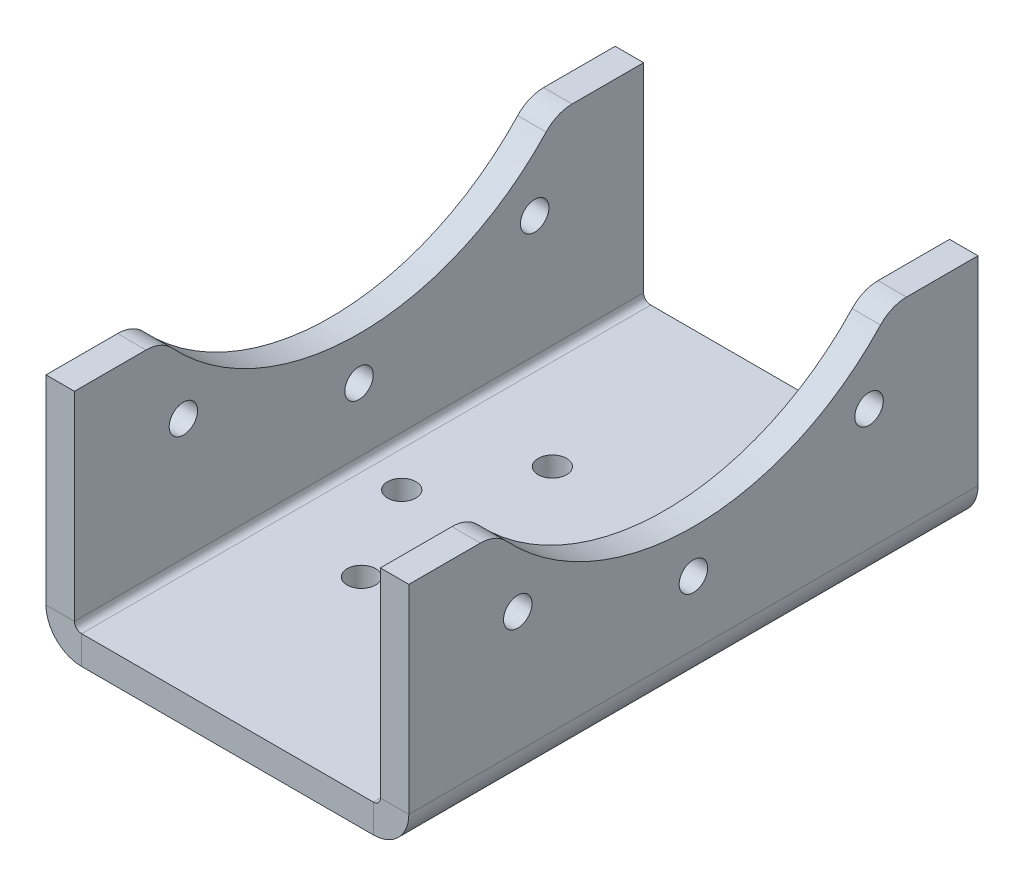
ISO-10303-21;
HEADER;
FILE_DESCRIPTION(('STEP AP214'),'2;1');
FILE_NAME('part.step','',(''),(''),'','','');
FILE_SCHEMA(('AUTOMOTIVE_DESIGN { 1 0 10303 214 1 1 1 1 }'));
ENDSEC;
DATA;
#1=APPLICATION_CONTEXT('core data for automotive mechanical design processes');
#2=APPLICATION_PROTOCOL_DEFINITION('international standard','automotive_design',2000,#1);
#3=PRODUCT_CONTEXT('',#1,'mechanical');
#4=PRODUCT('Part','Part','',(#3));
#5=PRODUCT_RELATED_PRODUCT_CATEGORY('part','',(#4));
#6=PRODUCT_DEFINITION_FORMATION('','',#4);
#7=PRODUCT_DEFINITION_CONTEXT('part definition',#1,'design');
#8=PRODUCT_DEFINITION('design','',#6,#7);
#9=PRODUCT_DEFINITION_SHAPE('','',#8);
#10=(LENGTH_UNIT() NAMED_UNIT(*) SI_UNIT(.MILLI.,.METRE.));
#11=(NAMED_UNIT(*) PLANE_ANGLE_UNIT() SI_UNIT($,.RADIAN.));
#12=(NAMED_UNIT(*) SI_UNIT($,.STERADIAN.) SOLID_ANGLE_UNIT());
#13=UNCERTAINTY_MEASURE_WITH_UNIT(LENGTH_MEASURE(1.E-05),#10,'distance_accuracy_value','');
#14=(GEOMETRIC_REPRESENTATION_CONTEXT(3) GLOBAL_UNCERTAINTY_ASSIGNED_CONTEXT((#13)) GLOBAL_UNIT_ASSIGNED_CONTEXT((#10,
#11,#12)) REPRESENTATION_CONTEXT('',''));
#15=CARTESIAN_POINT('',(0.,0.,0.));
#16=DIRECTION('',(0.,0.,1.));
#17=DIRECTION('',(1.,0.,0.));
#18=AXIS2_PLACEMENT_3D('',#15,#16,#17);
#19=CARTESIAN_POINT('',(-25.5,29.,80.));
#20=DIRECTION('',(0.,1.,0.));
#21=DIRECTION('',(0.,0.,1.));
#22=AXIS2_PLACEMENT_3D('',#19,#20,#21);
#23=PLANE('',#22);
#24=DIRECTION('',(0.,0.,-1.));
#25=VECTOR('',#24,1.);
#26=CARTESIAN_POINT('',(-25.5,29.,80.));
#27=LINE('',#26,#25);
#28=CARTESIAN_POINT('',(-25.5,29.,10.0500417362561));
#29=VERTEX_POINT('',#28);
#30=CARTESIAN_POINT('',(-25.5,29.,0.));
#31=VERTEX_POINT('',#30);
#32=EDGE_CURVE('E341',#29,#31,#27,.T.);
#33=ORIENTED_EDGE('',*,*,#32,.F.);
#34=DIRECTION('',(1.,0.,0.));
#35=VECTOR('',#34,1.);
#36=CARTESIAN_POINT('',(-21.5,29.,10.0500417362561));
#37=LINE('',#36,#35);
#38=CARTESIAN_POINT('',(-21.5,29.,10.0500417362561));
#39=VERTEX_POINT('',#38);
#40=EDGE_CURVE('E407',#29,#39,#37,.T.);
#41=ORIENTED_EDGE('',*,*,#40,.T.);
#42=DIRECTION('',(0.,0.,-1.));
#43=VECTOR('',#42,1.);
#44=CARTESIAN_POINT('',(-21.5,29.,80.));
#45=LINE('',#44,#43);
#46=CARTESIAN_POINT('',(-21.5,29.,0.));
#47=VERTEX_POINT('',#46);
#48=EDGE_CURVE('E206',#39,#47,#45,.T.);
#49=ORIENTED_EDGE('',*,*,#48,.T.);
#50=DIRECTION('',(1.,0.,0.));
#51=VECTOR('',#50,1.);
#52=CARTESIAN_POINT('',(-25.5,29.,0.));
#53=LINE('',#52,#51);
#54=EDGE_CURVE('E258',#31,#47,#53,.T.);
#55=ORIENTED_EDGE('',*,*,#54,.F.);
#56=EDGE_LOOP('',(#33,#41,#49,#55));
#57=FACE_BOUND('',#56,.T.);
#58=ADVANCED_FACE('F43',(#57),#23,.T.);
#59=CARTESIAN_POINT('',(21.5,29.,80.));
#60=DIRECTION('',(0.,1.,0.));
#61=DIRECTION('',(0.,0.,1.));
#62=AXIS2_PLACEMENT_3D('',#59,#60,#61);
#63=PLANE('',#62);
#64=DIRECTION('',(0.,0.,-1.));
#65=VECTOR('',#64,1.);
#66=CARTESIAN_POINT('',(21.5,29.,80.));
#67=LINE('',#66,#65);
#68=CARTESIAN_POINT('',(21.5,29.,10.0500417362561));
#69=VERTEX_POINT('',#68);
#70=CARTESIAN_POINT('',(21.5,29.,0.));
#71=VERTEX_POINT('',#70);
#72=EDGE_CURVE('E316',#69,#71,#67,.T.);
#73=ORIENTED_EDGE('',*,*,#72,.F.);
#74=DIRECTION('',(1.,0.,0.));
#75=VECTOR('',#74,1.);
#76=CARTESIAN_POINT('',(25.5,29.,10.0500417362561));
#77=LINE('',#76,#75);
#78=CARTESIAN_POINT('',(25.5,29.,10.0500417362561));
#79=VERTEX_POINT('',#78);
#80=EDGE_CURVE('E69',#69,#79,#77,.T.);
#81=ORIENTED_EDGE('',*,*,#80,.T.);
#82=DIRECTION('',(0.,0.,-1.));
#83=VECTOR('',#82,1.);
#84=CARTESIAN_POINT('',(25.5,29.,80.));
#85=LINE('',#84,#83);
#86=CARTESIAN_POINT('',(25.5,29.,0.));
#87=VERTEX_POINT('',#86);
#88=EDGE_CURVE('E321',#79,#87,#85,.T.);
#89=ORIENTED_EDGE('',*,*,#88,.T.);
#90=DIRECTION('',(1.,0.,0.));
#91=VECTOR('',#90,1.);
#92=CARTESIAN_POINT('',(21.5,29.,0.));
#93=LINE('',#92,#91);
#94=EDGE_CURVE('E283',#71,#87,#93,.T.);
#95=ORIENTED_EDGE('',*,*,#94,.F.);
#96=EDGE_LOOP('',(#73,#81,#89,#95));
#97=FACE_BOUND('',#96,.T.);
#98=ADVANCED_FACE('F511',(#97),#63,.T.);
#99=CARTESIAN_POINT('',(21.5,1.00000000000001,80.));
#100=DIRECTION('',(0.,0.,1.));
#101=DIRECTION('',(1.,0.,0.));
#102=AXIS2_PLACEMENT_3D('',#99,#100,#101);
#103=PLANE('',#102);
#104=DIRECTION('',(1.,0.,0.));
#105=VECTOR('',#104,1.);
#106=CARTESIAN_POINT('',(21.5,1.00000000000001,80.));
#107=LINE('',#106,#105);
#108=CARTESIAN_POINT('',(21.5,1.00000000000001,80.));
#109=VERTEX_POINT('',#108);
#110=CARTESIAN_POINT('',(25.5,1.,80.));
#111=VERTEX_POINT('',#110);
#112=EDGE_CURVE('E363',#109,#111,#107,.T.);
#113=ORIENTED_EDGE('',*,*,#112,.F.);
#114=CARTESIAN_POINT('',(20.5,1.00000000000001,80.));
#115=DIRECTION('',(0.,0.,1.));
#116=DIRECTION('',(1.,0.,0.));
#117=AXIS2_PLACEMENT_3D('',#114,#115,#116);
#118=CIRCLE('',#117,1.);
#119=CARTESIAN_POINT('',(20.5,0.,80.));
#120=VERTEX_POINT('',#119);
#121=EDGE_CURVE('E242',#109,#120,#118,.F.);
#122=ORIENTED_EDGE('',*,*,#121,.T.);
#123=DIRECTION('',(0.,1.,0.));
#124=VECTOR('',#123,1.);
#125=CARTESIAN_POINT('',(20.5,-3.99999999999999,80.));
#126=LINE('',#125,#124);
#127=CARTESIAN_POINT('',(20.5,-3.99999999999999,80.));
#128=VERTEX_POINT('',#127);
#129=EDGE_CURVE('E360',#128,#120,#126,.T.);
#130=ORIENTED_EDGE('',*,*,#129,.F.);
#131=CARTESIAN_POINT('',(20.5,1.00000000000001,80.));
#132=DIRECTION('',(0.,0.,1.));
#133=DIRECTION('',(1.,0.,0.));
#134=AXIS2_PLACEMENT_3D('',#131,#132,#133);
#135=CIRCLE('',#134,5.);
#136=EDGE_CURVE('E226',#111,#128,#135,.F.);
#137=ORIENTED_EDGE('',*,*,#136,.F.);
#138=EDGE_LOOP('',(#113,#122,#130,#137));
#139=FACE_BOUND('',#138,.T.);
#140=ADVANCED_FACE('F517',(#139),#103,.T.);
#141=CARTESIAN_POINT('',(20.5,-3.99999999999999,80.));
#142=DIRECTION('',(0.,0.,1.));
#143=DIRECTION('',(1.,0.,0.));
#144=AXIS2_PLACEMENT_3D('',#141,#142,#143);
#145=PLANE('',#144);
#146=DIRECTION('',(0.,-1.,0.));
#147=VECTOR('',#146,1.);
#148=CARTESIAN_POINT('',(21.5,0.,80.));
#149=LINE('',#148,#147);
#150=CARTESIAN_POINT('',(21.5,29.,80.));
#151=VERTEX_POINT('',#150);
#152=EDGE_CURVE('E238',#151,#109,#149,.T.);
#153=ORIENTED_EDGE('',*,*,#152,.T.);
#154=ORIENTED_EDGE('',*,*,#112,.T.);
#155=DIRECTION('',(0.,1.,0.));
#156=VECTOR('',#155,1.);
#157=CARTESIAN_POINT('',(25.5,0.,80.));
#158=LINE('',#157,#156);
#159=CARTESIAN_POINT('',(25.5,29.,80.));
#160=VERTEX_POINT('',#159);
#161=EDGE_CURVE('E230',#160,#111,#158,.F.);
#162=ORIENTED_EDGE('',*,*,#161,.F.);
#163=DIRECTION('',(1.,0.,0.));
#164=VECTOR('',#163,1.);
#165=CARTESIAN_POINT('',(21.5,29.,80.));
#166=LINE('',#165,#164);
#167=EDGE_CURVE('E234',#151,#160,#166,.T.);
#168=ORIENTED_EDGE('',*,*,#167,.F.);
#169=EDGE_LOOP('',(#153,#154,#162,#168));
#170=FACE_BOUND('',#169,.T.);
#171=ADVANCED_FACE('F557',(#170),#145,.T.);
#172=CARTESIAN_POINT('',(20.5,0.,0.));
#173=DIRECTION('',(0.,0.,-1.));
#174=DIRECTION('',(-1.,0.,0.));
#175=AXIS2_PLACEMENT_3D('',#172,#173,#174);
#176=PLANE('',#175);
#177=DIRECTION('',(0.,-1.,0.));
#178=VECTOR('',#177,1.);
#179=CARTESIAN_POINT('',(20.5,0.,0.));
#180=LINE('',#179,#178);
#181=CARTESIAN_POINT('',(20.5,0.,0.));
#182=VERTEX_POINT('',#181);
#183=CARTESIAN_POINT('',(20.5,-3.99999999999999,0.));
#184=VERTEX_POINT('',#183);
#185=EDGE_CURVE('E357',#182,#184,#180,.T.);
#186=ORIENTED_EDGE('',*,*,#185,.F.);
#187=CARTESIAN_POINT('',(20.5,1.00000000000001,0.));
#188=DIRECTION('',(0.,0.,1.));
#189=DIRECTION('',(1.,0.,0.));
#190=AXIS2_PLACEMENT_3D('',#187,#188,#189);
#191=CIRCLE('',#190,1.);
#192=CARTESIAN_POINT('',(21.5,1.00000000000001,0.));
#193=VERTEX_POINT('',#192);
#194=EDGE_CURVE('E291',#193,#182,#191,.F.);
#195=ORIENTED_EDGE('',*,*,#194,.F.);
#196=DIRECTION('',(-1.,0.,0.));
#197=VECTOR('',#196,1.);
#198=CARTESIAN_POINT('',(25.5,1.,0.));
#199=LINE('',#198,#197);
#200=CARTESIAN_POINT('',(25.5,1.,0.));
#201=VERTEX_POINT('',#200);
#202=EDGE_CURVE('E354',#201,#193,#199,.T.);
#203=ORIENTED_EDGE('',*,*,#202,.F.);
#204=CARTESIAN_POINT('',(20.5,1.00000000000001,0.));
#205=DIRECTION('',(0.,0.,1.));
#206=DIRECTION('',(1.,0.,0.));
#207=AXIS2_PLACEMENT_3D('',#204,#205,#206);
#208=CIRCLE('',#207,5.);
#209=EDGE_CURVE('E275',#201,#184,#208,.F.);
#210=ORIENTED_EDGE('',*,*,#209,.T.);
#211=EDGE_LOOP('',(#186,#195,#203,#210));
#212=FACE_BOUND('',#211,.T.);
#213=ADVANCED_FACE('F553',(#212),#176,.T.);
#214=CARTESIAN_POINT('',(25.5,1.,0.));
#215=DIRECTION('',(0.,0.,-1.));
#216=DIRECTION('',(-1.,0.,0.));
#217=AXIS2_PLACEMENT_3D('',#214,#215,#216);
#218=PLANE('',#217);
#219=DIRECTION('',(-1.,0.,0.));
#220=VECTOR('',#219,1.);
#221=CARTESIAN_POINT('',(-21.5,0.,0.));
#222=LINE('',#221,#220);
#223=CARTESIAN_POINT('',(-20.5,0.,0.));
#224=VERTEX_POINT('',#223);
#225=EDGE_CURVE('E295',#182,#224,#222,.T.);
#226=ORIENTED_EDGE('',*,*,#225,.F.);
#227=ORIENTED_EDGE('',*,*,#185,.T.);
#228=DIRECTION('',(-1.,0.,0.));
#229=VECTOR('',#228,1.);
#230=CARTESIAN_POINT('',(-21.5,-4.,0.));
#231=LINE('',#230,#229);
#232=CARTESIAN_POINT('',(-20.5,-4.,0.));
#233=VERTEX_POINT('',#232);
#234=EDGE_CURVE('E271',#184,#233,#231,.T.);
#235=ORIENTED_EDGE('',*,*,#234,.T.);
#236=DIRECTION('',(0.,1.,0.));
#237=VECTOR('',#236,1.);
#238=CARTESIAN_POINT('',(-20.5,-4.,0.));
#239=LINE('',#238,#237);
#240=EDGE_CURVE('E205',#233,#224,#239,.T.);
#241=ORIENTED_EDGE('',*,*,#240,.T.);
#242=EDGE_LOOP('',(#226,#227,#235,#241));
#243=FACE_BOUND('',#242,.T.);
#244=ADVANCED_FACE('F549',(#243),#218,.T.);
#245=CARTESIAN_POINT('',(-20.5,0.,80.));
#246=DIRECTION('',(0.,0.,1.));
#247=DIRECTION('',(1.,0.,0.));
#248=AXIS2_PLACEMENT_3D('',#245,#246,#247);
#249=PLANE('',#248);
#250=DIRECTION('',(0.,-1.,0.));
#251=VECTOR('',#250,1.);
#252=CARTESIAN_POINT('',(-20.5,0.,80.));
#253=LINE('',#252,#251);
#254=CARTESIAN_POINT('',(-20.5,0.,80.));
#255=VERTEX_POINT('',#254);
#256=CARTESIAN_POINT('',(-20.5,-4.,80.));
#257=VERTEX_POINT('',#256);
#258=EDGE_CURVE('E351',#255,#257,#253,.T.);
#259=ORIENTED_EDGE('',*,*,#258,.F.);
#260=CARTESIAN_POINT('',(-20.5,1.,80.));
#261=DIRECTION('',(0.,0.,1.));
#262=DIRECTION('',(1.,0.,0.));
#263=AXIS2_PLACEMENT_3D('',#260,#261,#262);
#264=CIRCLE('',#263,1.);
#265=CARTESIAN_POINT('',(-21.5,0.999999999999999,80.));
#266=VERTEX_POINT('',#265);
#267=EDGE_CURVE('E250',#255,#266,#264,.F.);
#268=ORIENTED_EDGE('',*,*,#267,.T.);
#269=DIRECTION('',(1.,0.,0.));
#270=VECTOR('',#269,1.);
#271=CARTESIAN_POINT('',(-25.5,0.999999999999999,80.));
#272=LINE('',#271,#270);
#273=CARTESIAN_POINT('',(-25.5,0.999999999999999,80.));
#274=VERTEX_POINT('',#273);
#275=EDGE_CURVE('E190',#274,#266,#272,.T.);
#276=ORIENTED_EDGE('',*,*,#275,.F.);
#277=CARTESIAN_POINT('',(-20.5,1.,80.));
#278=DIRECTION('',(0.,0.,1.));
#279=DIRECTION('',(1.,0.,0.));
#280=AXIS2_PLACEMENT_3D('',#277,#278,#279);
#281=CIRCLE('',#280,5.);
#282=EDGE_CURVE('E215',#257,#274,#281,.F.);
#283=ORIENTED_EDGE('',*,*,#282,.F.);
#284=EDGE_LOOP('',(#259,#268,#276,#283));
#285=FACE_BOUND('',#284,.T.);
#286=ADVANCED_FACE('F545',(#285),#249,.T.);
#287=CARTESIAN_POINT('',(-25.5,0.999999999999999,80.));
#288=DIRECTION('',(0.,0.,1.));
#289=DIRECTION('',(1.,0.,0.));
#290=AXIS2_PLACEMENT_3D('',#287,#288,#289);
#291=PLANE('',#290);
#292=DIRECTION('',(-1.,0.,0.));
#293=VECTOR('',#292,1.);
#294=CARTESIAN_POINT('',(-21.5,0.,80.));
#295=LINE('',#294,#293);
#296=EDGE_CURVE('E246',#120,#255,#295,.T.);
#297=ORIENTED_EDGE('',*,*,#296,.T.);
#298=ORIENTED_EDGE('',*,*,#258,.T.);
#299=DIRECTION('',(-1.,0.,0.));
#300=VECTOR('',#299,1.);
#301=CARTESIAN_POINT('',(-21.5,-4.,80.));
#302=LINE('',#301,#300);
#303=EDGE_CURVE('E222',#128,#257,#302,.T.);
#304=ORIENTED_EDGE('',*,*,#303,.F.);
#305=ORIENTED_EDGE('',*,*,#129,.T.);
#306=EDGE_LOOP('',(#297,#298,#304,#305));
#307=FACE_BOUND('',#306,.T.);
#308=ADVANCED_FACE('F541',(#307),#291,.T.);
#309=CARTESIAN_POINT('',(-21.5,0.999999999999999,0.));
#310=DIRECTION('',(0.,0.,-1.));
#311=DIRECTION('',(-1.,0.,0.));
#312=AXIS2_PLACEMENT_3D('',#309,#310,#311);
#313=PLANE('',#312);
#314=DIRECTION('',(-1.,0.,0.));
#315=VECTOR('',#314,1.);
#316=CARTESIAN_POINT('',(-21.5,0.999999999999999,0.));
#317=LINE('',#316,#315);
#318=CARTESIAN_POINT('',(-21.5,0.999999999999999,0.));
#319=VERTEX_POINT('',#318);
#320=CARTESIAN_POINT('',(-25.5,0.999999999999999,0.));
#321=VERTEX_POINT('',#320);
#322=EDGE_CURVE('E346',#319,#321,#317,.T.);
#323=ORIENTED_EDGE('',*,*,#322,.F.);
#324=CARTESIAN_POINT('',(-20.5,1.,0.));
#325=DIRECTION('',(0.,0.,1.));
#326=DIRECTION('',(1.,0.,0.));
#327=AXIS2_PLACEMENT_3D('',#324,#325,#326);
#328=CIRCLE('',#327,1.);
#329=EDGE_CURVE('E195',#224,#319,#328,.F.);
#330=ORIENTED_EDGE('',*,*,#329,.F.);
#331=ORIENTED_EDGE('',*,*,#240,.F.);
#332=CARTESIAN_POINT('',(-20.5,1.,0.));
#333=DIRECTION('',(0.,0.,1.));
#334=DIRECTION('',(1.,0.,0.));
#335=AXIS2_PLACEMENT_3D('',#332,#333,#334);
#336=CIRCLE('',#335,5.);
#337=EDGE_CURVE('E267',#233,#321,#336,.F.);
#338=ORIENTED_EDGE('',*,*,#337,.T.);
#339=EDGE_LOOP('',(#323,#330,#331,#338));
#340=FACE_BOUND('',#339,.T.);
#341=ADVANCED_FACE('F535',(#340),#313,.T.);
#342=CARTESIAN_POINT('',(-20.5,-4.,0.));
#343=DIRECTION('',(0.,0.,-1.));
#344=DIRECTION('',(-1.,0.,0.));
#345=AXIS2_PLACEMENT_3D('',#342,#343,#344);
#346=PLANE('',#345);
#347=DIRECTION('',(0.,1.,0.));
#348=VECTOR('',#347,1.);
#349=CARTESIAN_POINT('',(-21.5,0.,0.));
#350=LINE('',#349,#348);
#351=EDGE_CURVE('E254',#319,#47,#350,.T.);
#352=ORIENTED_EDGE('',*,*,#351,.F.);
#353=ORIENTED_EDGE('',*,*,#322,.T.);
#354=DIRECTION('',(0.,1.,0.));
#355=VECTOR('',#354,1.);
#356=CARTESIAN_POINT('',(-25.5,0.,0.));
#357=LINE('',#356,#355);
#358=EDGE_CURVE('E263',#321,#31,#357,.T.);
#359=ORIENTED_EDGE('',*,*,#358,.T.);
#360=ORIENTED_EDGE('',*,*,#54,.T.);
#361=EDGE_LOOP('',(#352,#353,#359,#360));
#362=FACE_BOUND('',#361,.T.);
#363=ADVANCED_FACE('F531',(#362),#346,.T.);
#364=CARTESIAN_POINT('',(-21.5,0.,80.));
#365=DIRECTION('',(-1.,0.,0.));
#366=DIRECTION('',(0.,0.,1.));
#367=AXIS2_PLACEMENT_3D('',#364,#365,#366);
#368=PLANE('',#367);
#369=CARTESIAN_POINT('',(-21.5,18.0212862362522,64.6869805962839));
#370=DIRECTION('',(-1.,0.,0.));
#371=DIRECTION('',(0.,0.,1.));
#372=AXIS2_PLACEMENT_3D('',#369,#370,#371);
#373=CIRCLE('',#372,2.);
#374=CARTESIAN_POINT('',(-21.5,18.0212862362522,66.6869805962839));
#375=VERTEX_POINT('',#374);
#376=EDGE_CURVE('E259',#375,#375,#373,.T.);
#377=ORIENTED_EDGE('',*,*,#376,.T.);
#378=EDGE_LOOP('',(#377));
#379=FACE_BOUND('',#378,.T.);
#380=CARTESIAN_POINT('',(-21.5,18.0212862362522,15.3130194037161));
#381=DIRECTION('',(-1.,0.,0.));
#382=DIRECTION('',(0.,0.,1.));
#383=AXIS2_PLACEMENT_3D('',#380,#381,#382);
#384=CIRCLE('',#383,2.00000000000001);
#385=CARTESIAN_POINT('',(-21.5,18.0212862362522,17.3130194037161));
#386=VERTEX_POINT('',#385);
#387=EDGE_CURVE('E381',#386,#386,#384,.T.);
#388=ORIENTED_EDGE('',*,*,#387,.T.);
#389=EDGE_LOOP('',(#388));
#390=FACE_BOUND('',#389,.T.);
#391=CARTESIAN_POINT('',(-21.5,9.99999999999999,40.));
#392=DIRECTION('',(-1.,0.,0.));
#393=DIRECTION('',(0.,0.,1.));
#394=AXIS2_PLACEMENT_3D('',#391,#392,#393);
#395=CIRCLE('',#394,1.99999999999998);
#396=CARTESIAN_POINT('',(-21.5,9.99999999999999,42.));
#397=VERTEX_POINT('',#396);
#398=EDGE_CURVE('E375',#397,#397,#395,.T.);
#399=ORIENTED_EDGE('',*,*,#398,.T.);
#400=EDGE_LOOP('',(#399));
#401=FACE_BOUND('',#400,.T.);
#402=CARTESIAN_POINT('',(-21.5,52.,40.));
#403=DIRECTION('',(-1.,0.,0.));
#404=DIRECTION('',(0.,0.,1.));
#405=AXIS2_PLACEMENT_3D('',#402,#403,#404);
#406=CIRCLE('',#405,36.);
#407=CARTESIAN_POINT('',(-21.5,27.4146341463415,13.702475670859));
#408=VERTEX_POINT('',#407);
#409=CARTESIAN_POINT('',(-21.5,27.4146341463415,66.297524329141));
#410=VERTEX_POINT('',#409);
#411=EDGE_CURVE('E376',#408,#410,#406,.T.);
#412=ORIENTED_EDGE('',*,*,#411,.T.);
#413=CARTESIAN_POINT('',(-21.5,24.,69.9499582637439));
#414=DIRECTION('',(-1.,0.,0.));
#415=DIRECTION('',(0.,0.,1.));
#416=AXIS2_PLACEMENT_3D('',#413,#414,#415);
#417=CIRCLE('',#416,5.);
#418=CARTESIAN_POINT('',(-21.5,29.,69.9499582637439));
#419=VERTEX_POINT('',#418);
#420=EDGE_CURVE('E201',#410,#419,#417,.F.);
#421=ORIENTED_EDGE('',*,*,#420,.T.);
#422=CARTESIAN_POINT('',(-21.5,29.,80.));
#423=VERTEX_POINT('',#422);
#424=EDGE_CURVE('E198',#423,#419,#45,.T.);
#425=ORIENTED_EDGE('',*,*,#424,.F.);
#426=DIRECTION('',(0.,1.,0.));
#427=VECTOR('',#426,1.);
#428=CARTESIAN_POINT('',(-21.5,0.,80.));
#429=LINE('',#428,#427);
#430=EDGE_CURVE('E183',#266,#423,#429,.T.);
#431=ORIENTED_EDGE('',*,*,#430,.F.);
#432=DIRECTION('',(0.,0.,-1.));
#433=VECTOR('',#432,1.);
#434=CARTESIAN_POINT('',(-21.5,0.999999999999999,80.));
#435=LINE('',#434,#433);
#436=EDGE_CURVE('E253',#266,#319,#435,.T.);
#437=ORIENTED_EDGE('',*,*,#436,.T.);
#438=ORIENTED_EDGE('',*,*,#351,.T.);
#439=ORIENTED_EDGE('',*,*,#48,.F.);
#440=CARTESIAN_POINT('',(-21.5,24.,10.0500417362561));
#441=DIRECTION('',(-1.,0.,0.));
#442=DIRECTION('',(0.,0.,1.));
#443=AXIS2_PLACEMENT_3D('',#440,#441,#442);
#444=CIRCLE('',#443,5.);
#445=EDGE_CURVE('E393',#39,#408,#444,.F.);
#446=ORIENTED_EDGE('',*,*,#445,.T.);
#447=EDGE_LOOP('',(#412,#421,#425,#431,#437,#438,#439,#446));
#448=FACE_BOUND('',#447,.T.);
#449=ADVANCED_FACE('F200',(#379,#390,#401,#448),#368,.F.);
#450=ORIENTED_EDGE('',*,*,#424,.T.);
#451=DIRECTION('',(1.,0.,0.));
#452=VECTOR('',#451,1.);
#453=CARTESIAN_POINT('',(-25.5,29.,69.9499582637439));
#454=LINE('',#453,#452);
#455=CARTESIAN_POINT('',(-25.5,29.,69.9499582637439));
#456=VERTEX_POINT('',#455);
#457=EDGE_CURVE('E398',#419,#456,#454,.F.);
#458=ORIENTED_EDGE('',*,*,#457,.T.);
#459=CARTESIAN_POINT('',(-25.5,29.,80.));
#460=VERTEX_POINT('',#459);
#461=EDGE_CURVE('E210',#460,#456,#27,.T.);
#462=ORIENTED_EDGE('',*,*,#461,.F.);
#463=DIRECTION('',(1.,0.,0.));
#464=VECTOR('',#463,1.);
#465=CARTESIAN_POINT('',(-25.5,29.,80.));
#466=LINE('',#465,#464);
#467=EDGE_CURVE('E188',#460,#423,#466,.T.);
#468=ORIENTED_EDGE('',*,*,#467,.T.);
#469=EDGE_LOOP('',(#450,#458,#462,#468));
#470=FACE_BOUND('',#469,.T.);
#471=ADVANCED_FACE('F208',(#470),#23,.T.);
#472=CARTESIAN_POINT('',(-25.5,0.,80.));
#473=DIRECTION('',(-1.,0.,0.));
#474=DIRECTION('',(0.,0.,1.));
#475=AXIS2_PLACEMENT_3D('',#472,#473,#474);
#476=PLANE('',#475);
#477=CARTESIAN_POINT('',(-25.5,18.0212862362522,64.6869805962839));
#478=DIRECTION('',(-1.,0.,0.));
#479=DIRECTION('',(0.,0.,1.));
#480=AXIS2_PLACEMENT_3D('',#477,#478,#479);
#481=CIRCLE('',#480,2.);
#482=CARTESIAN_POINT('',(-25.5,18.0212862362522,66.6869805962839));
#483=VERTEX_POINT('',#482);
#484=EDGE_CURVE('E453',#483,#483,#481,.T.);
#485=ORIENTED_EDGE('',*,*,#484,.F.);
#486=EDGE_LOOP('',(#485));
#487=FACE_BOUND('',#486,.T.);
#488=CARTESIAN_POINT('',(-25.5,18.0212862362522,15.3130194037161));
#489=DIRECTION('',(-1.,0.,0.));
#490=DIRECTION('',(0.,0.,1.));
#491=AXIS2_PLACEMENT_3D('',#488,#489,#490);
#492=CIRCLE('',#491,2.00000000000001);
#493=CARTESIAN_POINT('',(-25.5,18.0212862362522,17.3130194037161));
#494=VERTEX_POINT('',#493);
#495=EDGE_CURVE('E464',#494,#494,#492,.T.);
#496=ORIENTED_EDGE('',*,*,#495,.F.);
#497=EDGE_LOOP('',(#496));
#498=FACE_BOUND('',#497,.T.);
#499=CARTESIAN_POINT('',(-25.5,9.99999999999999,40.));
#500=DIRECTION('',(-1.,0.,0.));
#501=DIRECTION('',(0.,0.,1.));
#502=AXIS2_PLACEMENT_3D('',#499,#500,#501);
#503=CIRCLE('',#502,1.99999999999998);
#504=CARTESIAN_POINT('',(-25.5,9.99999999999999,42.));
#505=VERTEX_POINT('',#504);
#506=EDGE_CURVE('E1046',#505,#505,#503,.T.);
#507=ORIENTED_EDGE('',*,*,#506,.F.);
#508=EDGE_LOOP('',(#507));
#509=FACE_BOUND('',#508,.T.);
#510=ORIENTED_EDGE('',*,*,#461,.T.);
#511=CARTESIAN_POINT('',(-25.5,24.,69.9499582637439));
#512=DIRECTION('',(-1.,0.,0.));
#513=DIRECTION('',(0.,0.,1.));
#514=AXIS2_PLACEMENT_3D('',#511,#512,#513);
#515=CIRCLE('',#514,5.);
#516=CARTESIAN_POINT('',(-25.5,27.4146341463415,66.297524329141));
#517=VERTEX_POINT('',#516);
#518=EDGE_CURVE('E404',#456,#517,#515,.T.);
#519=ORIENTED_EDGE('',*,*,#518,.T.);
#520=CARTESIAN_POINT('',(-25.5,52.,40.));
#521=DIRECTION('',(-1.,0.,0.));
#522=DIRECTION('',(0.,0.,1.));
#523=AXIS2_PLACEMENT_3D('',#520,#521,#522);
#524=CIRCLE('',#523,36.);
#525=CARTESIAN_POINT('',(-25.5,27.4146341463415,13.702475670859));
#526=VERTEX_POINT('',#525);
#527=EDGE_CURVE('E471',#526,#517,#524,.T.);
#528=ORIENTED_EDGE('',*,*,#527,.F.);
#529=CARTESIAN_POINT('',(-25.5,24.,10.0500417362561));
#530=DIRECTION('',(-1.,0.,0.));
#531=DIRECTION('',(0.,0.,1.));
#532=AXIS2_PLACEMENT_3D('',#529,#530,#531);
#533=CIRCLE('',#532,5.);
#534=EDGE_CURVE('E401',#526,#29,#533,.T.);
#535=ORIENTED_EDGE('',*,*,#534,.T.);
#536=ORIENTED_EDGE('',*,*,#32,.T.);
#537=ORIENTED_EDGE('',*,*,#358,.F.);
#538=DIRECTION('',(0.,0.,-1.));
#539=VECTOR('',#538,1.);
#540=CARTESIAN_POINT('',(-25.5,0.999999999999999,80.));
#541=LINE('',#540,#539);
#542=EDGE_CURVE('E337',#274,#321,#541,.T.);
#543=ORIENTED_EDGE('',*,*,#542,.F.);
#544=DIRECTION('',(0.,1.,0.));
#545=VECTOR('',#544,1.);
#546=CARTESIAN_POINT('',(-25.5,0.,80.));
#547=LINE('',#546,#545);
#548=EDGE_CURVE('E212',#274,#460,#547,.T.);
#549=ORIENTED_EDGE('',*,*,#548,.T.);
#550=EDGE_LOOP('',(#510,#519,#528,#535,#536,#537,#543,#549));
#551=FACE_BOUND('',#550,.T.);
#552=ADVANCED_FACE('F524',(#487,#498,#509,#551),#476,.T.);
#553=CARTESIAN_POINT('',(-20.5,1.,80.));
#554=DIRECTION('',(0.,0.,-1.));
#555=DIRECTION('',(-1.,0.,0.));
#556=AXIS2_PLACEMENT_3D('',#553,#554,#555);
#557=CYLINDRICAL_SURFACE('',#556,5.);
#558=ORIENTED_EDGE('',*,*,#337,.F.);
#559=DIRECTION('',(0.,0.,-1.));
#560=VECTOR('',#559,1.);
#561=CARTESIAN_POINT('',(-20.5,-4.,80.));
#562=LINE('',#561,#560);
#563=EDGE_CURVE('E333',#257,#233,#562,.T.);
#564=ORIENTED_EDGE('',*,*,#563,.F.);
#565=ORIENTED_EDGE('',*,*,#282,.T.);
#566=ORIENTED_EDGE('',*,*,#542,.T.);
#567=EDGE_LOOP('',(#558,#564,#565,#566));
#568=FACE_BOUND('',#567,.T.);
#569=ADVANCED_FACE('F529',(#568),#557,.T.);
#570=CARTESIAN_POINT('',(-21.5,-4.,80.));
#571=DIRECTION('',(0.,-1.,0.));
#572=DIRECTION('',(1.,0.,0.));
#573=AXIS2_PLACEMENT_3D('',#570,#571,#572);
#574=PLANE('',#573);
#575=CARTESIAN_POINT('',(15.5,-3.99999999999999,40.));
#576=DIRECTION('',(0.,-1.,0.));
#577=DIRECTION('',(1.,0.,0.));
#578=AXIS2_PLACEMENT_3D('',#575,#576,#577);
#579=CIRCLE('',#578,2.00000000000001);
#580=CARTESIAN_POINT('',(17.5,-3.99999999999999,40.));
#581=VERTEX_POINT('',#580);
#582=EDGE_CURVE('E435',#581,#581,#579,.T.);
#583=ORIENTED_EDGE('',*,*,#582,.F.);
#584=EDGE_LOOP('',(#583));
#585=FACE_BOUND('',#584,.T.);
#586=CARTESIAN_POINT('',(-7.75000000000001,-4.,26.5766062413412));
#587=DIRECTION('',(0.,-1.,0.));
#588=DIRECTION('',(1.,0.,0.));
#589=AXIS2_PLACEMENT_3D('',#586,#587,#588);
#590=CIRCLE('',#589,2.);
#591=CARTESIAN_POINT('',(-5.75,-4.,26.5766062413412));
#592=VERTEX_POINT('',#591);
#593=EDGE_CURVE('E1028',#592,#592,#590,.T.);
#594=ORIENTED_EDGE('',*,*,#593,.F.);
#595=EDGE_LOOP('',(#594));
#596=FACE_BOUND('',#595,.T.);
#597=CARTESIAN_POINT('',(7.74999999999999,-3.99999999999999,53.4233937586588));
#598=DIRECTION('',(0.,-1.,0.));
#599=DIRECTION('',(1.,0.,0.));
#600=AXIS2_PLACEMENT_3D('',#597,#598,#599);
#601=CIRCLE('',#600,2.);
#602=CARTESIAN_POINT('',(9.74999999999999,-3.99999999999999,53.4233937586588));
#603=VERTEX_POINT('',#602);
#604=EDGE_CURVE('E1031',#603,#603,#601,.T.);
#605=ORIENTED_EDGE('',*,*,#604,.F.);
#606=EDGE_LOOP('',(#605));
#607=FACE_BOUND('',#606,.T.);
#608=CARTESIAN_POINT('',(-7.75000000000001,-4.,53.4233937586588));
#609=DIRECTION('',(0.,-1.,0.));
#610=DIRECTION('',(1.,0.,0.));
#611=AXIS2_PLACEMENT_3D('',#608,#609,#610);
#612=CIRCLE('',#611,2.);
#613=CARTESIAN_POINT('',(-5.75000000000001,-4.,53.4233937586588));
#614=VERTEX_POINT('',#613);
#615=EDGE_CURVE('E1036',#614,#614,#612,.T.);
#616=ORIENTED_EDGE('',*,*,#615,.F.);
#617=EDGE_LOOP('',(#616));
#618=FACE_BOUND('',#617,.T.);
#619=CARTESIAN_POINT('',(-15.5,-4.,40.));
#620=DIRECTION('',(0.,-1.,0.));
#621=DIRECTION('',(1.,0.,0.));
#622=AXIS2_PLACEMENT_3D('',#619,#620,#621);
#623=CIRCLE('',#622,2.);
#624=CARTESIAN_POINT('',(-13.5,-4.,40.));
#625=VERTEX_POINT('',#624);
#626=EDGE_CURVE('E1025',#625,#625,#623,.T.);
#627=ORIENTED_EDGE('',*,*,#626,.F.);
#628=EDGE_LOOP('',(#627));
#629=FACE_BOUND('',#628,.T.);
#630=CARTESIAN_POINT('',(7.74999999999999,-3.99999999999999,26.5766062413412));
#631=DIRECTION('',(0.,-1.,0.));
#632=DIRECTION('',(1.,0.,0.));
#633=AXIS2_PLACEMENT_3D('',#630,#631,#632);
#634=CIRCLE('',#633,2.);
#635=CARTESIAN_POINT('',(9.74999999999999,-3.99999999999999,26.5766062413412));
#636=VERTEX_POINT('',#635);
#637=EDGE_CURVE('E1021',#636,#636,#634,.T.);
#638=ORIENTED_EDGE('',*,*,#637,.F.);
#639=EDGE_LOOP('',(#638));
#640=FACE_BOUND('',#639,.T.);
#641=ORIENTED_EDGE('',*,*,#234,.F.);
#642=DIRECTION('',(0.,0.,-1.));
#643=VECTOR('',#642,1.);
#644=CARTESIAN_POINT('',(20.5,-3.99999999999999,80.));
#645=LINE('',#644,#643);
#646=EDGE_CURVE('E329',#128,#184,#645,.T.);
#647=ORIENTED_EDGE('',*,*,#646,.F.);
#648=ORIENTED_EDGE('',*,*,#303,.T.);
#649=ORIENTED_EDGE('',*,*,#563,.T.);
#650=EDGE_LOOP('',(#641,#647,#648,#649));
#651=FACE_BOUND('',#650,.T.);
#652=ADVANCED_FACE('F675',(#585,#596,#607,#618,#629,#640,#651),#574,.T.);
#653=CARTESIAN_POINT('',(20.5,1.00000000000001,80.));
#654=DIRECTION('',(0.,0.,-1.));
#655=DIRECTION('',(-1.,0.,0.));
#656=AXIS2_PLACEMENT_3D('',#653,#654,#655);
#657=CYLINDRICAL_SURFACE('',#656,5.);
#658=ORIENTED_EDGE('',*,*,#209,.F.);
#659=DIRECTION('',(0.,0.,-1.));
#660=VECTOR('',#659,1.);
#661=CARTESIAN_POINT('',(25.5,1.,80.));
#662=LINE('',#661,#660);
#663=EDGE_CURVE('E325',#111,#201,#662,.T.);
#664=ORIENTED_EDGE('',*,*,#663,.F.);
#665=ORIENTED_EDGE('',*,*,#136,.T.);
#666=ORIENTED_EDGE('',*,*,#646,.T.);
#667=EDGE_LOOP('',(#658,#664,#665,#666));
#668=FACE_BOUND('',#667,.T.);
#669=ADVANCED_FACE('F598',(#668),#657,.T.);
#670=CARTESIAN_POINT('',(25.5,0.,80.));
#671=DIRECTION('',(1.,0.,0.));
#672=DIRECTION('',(0.,0.,-1.));
#673=AXIS2_PLACEMENT_3D('',#670,#671,#672);
#674=PLANE('',#673);
#675=CARTESIAN_POINT('',(25.5,18.0212862362522,64.6869805962839));
#676=DIRECTION('',(-1.,0.,0.));
#677=DIRECTION('',(0.,0.,1.));
#678=AXIS2_PLACEMENT_3D('',#675,#676,#677);
#679=CIRCLE('',#678,2.);
#680=CARTESIAN_POINT('',(25.5,18.0212862362522,66.6869805962839));
#681=VERTEX_POINT('',#680);
#682=EDGE_CURVE('E458',#681,#681,#679,.T.);
#683=ORIENTED_EDGE('',*,*,#682,.T.);
#684=EDGE_LOOP('',(#683));
#685=FACE_BOUND('',#684,.T.);
#686=CARTESIAN_POINT('',(25.5,18.0212862362522,15.3130194037161));
#687=DIRECTION('',(-1.,0.,0.));
#688=DIRECTION('',(0.,0.,1.));
#689=AXIS2_PLACEMENT_3D('',#686,#687,#688);
#690=CIRCLE('',#689,2.00000000000001);
#691=CARTESIAN_POINT('',(25.5,18.0212862362522,17.3130194037161));
#692=VERTEX_POINT('',#691);
#693=EDGE_CURVE('E1050',#692,#692,#690,.T.);
#694=ORIENTED_EDGE('',*,*,#693,.T.);
#695=EDGE_LOOP('',(#694));
#696=FACE_BOUND('',#695,.T.);
#697=CARTESIAN_POINT('',(25.5,9.99999999999999,40.));
#698=DIRECTION('',(-1.,0.,0.));
#699=DIRECTION('',(0.,0.,1.));
#700=AXIS2_PLACEMENT_3D('',#697,#698,#699);
#701=CIRCLE('',#700,1.99999999999998);
#702=CARTESIAN_POINT('',(25.5,9.99999999999999,42.));
#703=VERTEX_POINT('',#702);
#704=EDGE_CURVE('E475',#703,#703,#701,.T.);
#705=ORIENTED_EDGE('',*,*,#704,.T.);
#706=EDGE_LOOP('',(#705));
#707=FACE_BOUND('',#706,.T.);
#708=ORIENTED_EDGE('',*,*,#88,.F.);
#709=CARTESIAN_POINT('',(25.5,24.,10.0500417362561));
#710=DIRECTION('',(1.,0.,0.));
#711=DIRECTION('',(0.,0.,-1.));
#712=AXIS2_PLACEMENT_3D('',#709,#710,#711);
#713=CIRCLE('',#712,5.);
#714=CARTESIAN_POINT('',(25.5,27.4146341463415,13.702475670859));
#715=VERTEX_POINT('',#714);
#716=EDGE_CURVE('E53',#79,#715,#713,.T.);
#717=ORIENTED_EDGE('',*,*,#716,.T.);
#718=CARTESIAN_POINT('',(25.5,52.,40.));
#719=DIRECTION('',(-1.,0.,0.));
#720=DIRECTION('',(0.,0.,1.));
#721=AXIS2_PLACEMENT_3D('',#718,#719,#720);
#722=CIRCLE('',#721,36.);
#723=CARTESIAN_POINT('',(25.5,27.4146341463415,66.297524329141));
#724=VERTEX_POINT('',#723);
#725=EDGE_CURVE('E468',#715,#724,#722,.T.);
#726=ORIENTED_EDGE('',*,*,#725,.T.);
#727=CARTESIAN_POINT('',(25.5,24.,69.9499582637439));
#728=DIRECTION('',(1.,0.,0.));
#729=DIRECTION('',(0.,0.,-1.));
#730=AXIS2_PLACEMENT_3D('',#727,#728,#729);
#731=CIRCLE('',#730,5.);
#732=CARTESIAN_POINT('',(25.5,29.,69.9499582637439));
#733=VERTEX_POINT('',#732);
#734=EDGE_CURVE('E61',#724,#733,#731,.T.);
#735=ORIENTED_EDGE('',*,*,#734,.T.);
#736=EDGE_CURVE('E322',#160,#733,#85,.T.);
#737=ORIENTED_EDGE('',*,*,#736,.F.);
#738=ORIENTED_EDGE('',*,*,#161,.T.);
#739=ORIENTED_EDGE('',*,*,#663,.T.);
#740=DIRECTION('',(0.,1.,0.));
#741=VECTOR('',#740,1.);
#742=CARTESIAN_POINT('',(25.5,0.,0.));
#743=LINE('',#742,#741);
#744=EDGE_CURVE('E279',#87,#201,#743,.F.);
#745=ORIENTED_EDGE('',*,*,#744,.F.);
#746=EDGE_LOOP('',(#708,#717,#726,#735,#737,#738,#739,#745));
#747=FACE_BOUND('',#746,.T.);
#748=ADVANCED_FACE('F578',(#685,#696,#707,#747),#674,.T.);
#749=ORIENTED_EDGE('',*,*,#736,.T.);
#750=DIRECTION('',(1.,0.,0.));
#751=VECTOR('',#750,1.);
#752=CARTESIAN_POINT('',(21.5,29.,69.9499582637439));
#753=LINE('',#752,#751);
#754=CARTESIAN_POINT('',(21.5,29.,69.9499582637439));
#755=VERTEX_POINT('',#754);
#756=EDGE_CURVE('E11',#733,#755,#753,.F.);
#757=ORIENTED_EDGE('',*,*,#756,.T.);
#758=EDGE_CURVE('E317',#151,#755,#67,.T.);
#759=ORIENTED_EDGE('',*,*,#758,.F.);
#760=ORIENTED_EDGE('',*,*,#167,.T.);
#761=EDGE_LOOP('',(#749,#757,#759,#760));
#762=FACE_BOUND('',#761,.T.);
#763=ADVANCED_FACE('F519',(#762),#63,.T.);
#764=CARTESIAN_POINT('',(21.5,0.,80.));
#765=DIRECTION('',(1.,0.,0.));
#766=DIRECTION('',(0.,0.,-1.));
#767=AXIS2_PLACEMENT_3D('',#764,#765,#766);
#768=PLANE('',#767);
#769=CARTESIAN_POINT('',(21.5,18.0212862362522,64.6869805962839));
#770=DIRECTION('',(1.,0.,0.));
#771=DIRECTION('',(0.,0.,-1.));
#772=AXIS2_PLACEMENT_3D('',#769,#770,#771);
#773=CIRCLE('',#772,2.);
#774=CARTESIAN_POINT('',(21.5,18.0212862362522,62.6869805962839));
#775=VERTEX_POINT('',#774);
#776=EDGE_CURVE('E382',#775,#775,#773,.T.);
#777=ORIENTED_EDGE('',*,*,#776,.T.);
#778=EDGE_LOOP('',(#777));
#779=FACE_BOUND('',#778,.T.);
#780=CARTESIAN_POINT('',(21.5,18.0212862362522,15.3130194037161));
#781=DIRECTION('',(1.,0.,0.));
#782=DIRECTION('',(0.,0.,-1.));
#783=AXIS2_PLACEMENT_3D('',#780,#781,#782);
#784=CIRCLE('',#783,2.00000000000001);
#785=CARTESIAN_POINT('',(21.5,18.0212862362522,13.3130194037161));
#786=VERTEX_POINT('',#785);
#787=EDGE_CURVE('E377',#786,#786,#784,.T.);
#788=ORIENTED_EDGE('',*,*,#787,.T.);
#789=EDGE_LOOP('',(#788));
#790=FACE_BOUND('',#789,.T.);
#791=CARTESIAN_POINT('',(21.5,9.99999999999999,40.));
#792=DIRECTION('',(1.,0.,0.));
#793=DIRECTION('',(0.,0.,-1.));
#794=AXIS2_PLACEMENT_3D('',#791,#792,#793);
#795=CIRCLE('',#794,1.99999999999998);
#796=CARTESIAN_POINT('',(21.5,9.99999999999999,38.));
#797=VERTEX_POINT('',#796);
#798=EDGE_CURVE('E371',#797,#797,#795,.T.);
#799=ORIENTED_EDGE('',*,*,#798,.T.);
#800=EDGE_LOOP('',(#799));
#801=FACE_BOUND('',#800,.T.);
#802=CARTESIAN_POINT('',(21.5,52.,40.));
#803=DIRECTION('',(1.,0.,0.));
#804=DIRECTION('',(0.,0.,-1.));
#805=AXIS2_PLACEMENT_3D('',#802,#803,#804);
#806=CIRCLE('',#805,36.);
#807=CARTESIAN_POINT('',(21.5,27.4146341463415,66.297524329141));
#808=VERTEX_POINT('',#807);
#809=CARTESIAN_POINT('',(21.5,27.4146341463415,13.702475670859));
#810=VERTEX_POINT('',#809);
#811=EDGE_CURVE('E366',#808,#810,#806,.T.);
#812=ORIENTED_EDGE('',*,*,#811,.T.);
#813=CARTESIAN_POINT('',(21.5,24.,10.0500417362561));
#814=DIRECTION('',(1.,0.,0.));
#815=DIRECTION('',(0.,0.,-1.));
#816=AXIS2_PLACEMENT_3D('',#813,#814,#815);
#817=CIRCLE('',#816,5.);
#818=EDGE_CURVE('E421',#810,#69,#817,.F.);
#819=ORIENTED_EDGE('',*,*,#818,.T.);
#820=ORIENTED_EDGE('',*,*,#72,.T.);
#821=DIRECTION('',(0.,-1.,0.));
#822=VECTOR('',#821,1.);
#823=CARTESIAN_POINT('',(21.5,0.,0.));
#824=LINE('',#823,#822);
#825=EDGE_CURVE('E287',#71,#193,#824,.T.);
#826=ORIENTED_EDGE('',*,*,#825,.T.);
#827=DIRECTION('',(0.,0.,-1.));
#828=VECTOR('',#827,1.);
#829=CARTESIAN_POINT('',(21.5,1.00000000000001,80.));
#830=LINE('',#829,#828);
#831=EDGE_CURVE('E312',#109,#193,#830,.T.);
#832=ORIENTED_EDGE('',*,*,#831,.F.);
#833=ORIENTED_EDGE('',*,*,#152,.F.);
#834=ORIENTED_EDGE('',*,*,#758,.T.);
#835=CARTESIAN_POINT('',(21.5,24.,69.9499582637439));
#836=DIRECTION('',(1.,0.,0.));
#837=DIRECTION('',(0.,0.,-1.));
#838=AXIS2_PLACEMENT_3D('',#835,#836,#837);
#839=CIRCLE('',#838,5.);
#840=EDGE_CURVE('E418',#755,#808,#839,.F.);
#841=ORIENTED_EDGE('',*,*,#840,.T.);
#842=EDGE_LOOP('',(#812,#819,#820,#826,#832,#833,#834,#841));
#843=FACE_BOUND('',#842,.T.);
#844=ADVANCED_FACE('F589',(#779,#790,#801,#843),#768,.F.);
#845=CARTESIAN_POINT('',(20.5,1.00000000000001,80.));
#846=DIRECTION('',(0.,0.,-1.));
#847=DIRECTION('',(-1.,0.,0.));
#848=AXIS2_PLACEMENT_3D('',#845,#846,#847);
#849=CYLINDRICAL_SURFACE('',#848,1.);
#850=ORIENTED_EDGE('',*,*,#194,.T.);
#851=DIRECTION('',(0.,0.,-1.));
#852=VECTOR('',#851,1.);
#853=CARTESIAN_POINT('',(20.5,0.,80.));
#854=LINE('',#853,#852);
#855=EDGE_CURVE('E308',#120,#182,#854,.T.);
#856=ORIENTED_EDGE('',*,*,#855,.F.);
#857=ORIENTED_EDGE('',*,*,#121,.F.);
#858=ORIENTED_EDGE('',*,*,#831,.T.);
#859=EDGE_LOOP('',(#850,#856,#857,#858));
#860=FACE_BOUND('',#859,.T.);
#861=ADVANCED_FACE('F609',(#860),#849,.F.);
#862=CARTESIAN_POINT('',(-21.5,0.,80.));
#863=DIRECTION('',(0.,-1.,0.));
#864=DIRECTION('',(1.,0.,0.));
#865=AXIS2_PLACEMENT_3D('',#862,#863,#864);
#866=PLANE('',#865);
#867=CARTESIAN_POINT('',(15.5,0.,40.));
#868=DIRECTION('',(0.,-1.,0.));
#869=DIRECTION('',(1.,0.,0.));
#870=AXIS2_PLACEMENT_3D('',#867,#868,#869);
#871=CIRCLE('',#870,2.00000000000001);
#872=CARTESIAN_POINT('',(17.5,0.,40.));
#873=VERTEX_POINT('',#872);
#874=EDGE_CURVE('E47',#873,#873,#871,.T.);
#875=ORIENTED_EDGE('',*,*,#874,.T.);
#876=EDGE_LOOP('',(#875));
#877=FACE_BOUND('',#876,.T.);
#878=CARTESIAN_POINT('',(-7.75000000000001,0.,26.5766062413412));
#879=DIRECTION('',(0.,-1.,0.));
#880=DIRECTION('',(1.,0.,0.));
#881=AXIS2_PLACEMENT_3D('',#878,#879,#880);
#882=CIRCLE('',#881,2.);
#883=CARTESIAN_POINT('',(-5.75000000000001,0.,26.5766062413412));
#884=VERTEX_POINT('',#883);
#885=EDGE_CURVE('E446',#884,#884,#882,.T.);
#886=ORIENTED_EDGE('',*,*,#885,.T.);
#887=EDGE_LOOP('',(#886));
#888=FACE_BOUND('',#887,.T.);
#889=CARTESIAN_POINT('',(7.74999999999999,0.,53.4233937586588));
#890=DIRECTION('',(0.,-1.,0.));
#891=DIRECTION('',(1.,0.,0.));
#892=AXIS2_PLACEMENT_3D('',#889,#890,#891);
#893=CIRCLE('',#892,2.);
#894=CARTESIAN_POINT('',(9.74999999999998,0.,53.4233937586588));
#895=VERTEX_POINT('',#894);
#896=EDGE_CURVE('E443',#895,#895,#893,.T.);
#897=ORIENTED_EDGE('',*,*,#896,.T.);
#898=EDGE_LOOP('',(#897));
#899=FACE_BOUND('',#898,.T.);
#900=CARTESIAN_POINT('',(-7.75000000000001,0.,53.4233937586588));
#901=DIRECTION('',(0.,-1.,0.));
#902=DIRECTION('',(1.,0.,0.));
#903=AXIS2_PLACEMENT_3D('',#900,#901,#902);
#904=CIRCLE('',#903,2.);
#905=CARTESIAN_POINT('',(-5.75000000000001,0.,53.4233937586588));
#906=VERTEX_POINT('',#905);
#907=EDGE_CURVE('E439',#906,#906,#904,.T.);
#908=ORIENTED_EDGE('',*,*,#907,.T.);
#909=EDGE_LOOP('',(#908));
#910=FACE_BOUND('',#909,.T.);
#911=CARTESIAN_POINT('',(-15.5,0.,40.));
#912=DIRECTION('',(0.,-1.,0.));
#913=DIRECTION('',(1.,0.,0.));
#914=AXIS2_PLACEMENT_3D('',#911,#912,#913);
#915=CIRCLE('',#914,2.);
#916=CARTESIAN_POINT('',(-13.5,0.,40.));
#917=VERTEX_POINT('',#916);
#918=EDGE_CURVE('E434',#917,#917,#915,.T.);
#919=ORIENTED_EDGE('',*,*,#918,.T.);
#920=EDGE_LOOP('',(#919));
#921=FACE_BOUND('',#920,.T.);
#922=CARTESIAN_POINT('',(7.74999999999999,0.,26.5766062413412));
#923=DIRECTION('',(0.,-1.,0.));
#924=DIRECTION('',(1.,0.,0.));
#925=AXIS2_PLACEMENT_3D('',#922,#923,#924);
#926=CIRCLE('',#925,2.);
#927=CARTESIAN_POINT('',(9.74999999999998,0.,26.5766062413412));
#928=VERTEX_POINT('',#927);
#929=EDGE_CURVE('E430',#928,#928,#926,.T.);
#930=ORIENTED_EDGE('',*,*,#929,.T.);
#931=EDGE_LOOP('',(#930));
#932=FACE_BOUND('',#931,.T.);
#933=ORIENTED_EDGE('',*,*,#225,.T.);
#934=DIRECTION('',(0.,0.,-1.));
#935=VECTOR('',#934,1.);
#936=CARTESIAN_POINT('',(-20.5,0.,80.));
#937=LINE('',#936,#935);
#938=EDGE_CURVE('E304',#255,#224,#937,.T.);
#939=ORIENTED_EDGE('',*,*,#938,.F.);
#940=ORIENTED_EDGE('',*,*,#296,.F.);
#941=ORIENTED_EDGE('',*,*,#855,.T.);
#942=EDGE_LOOP('',(#933,#939,#940,#941));
#943=FACE_BOUND('',#942,.T.);
#944=ADVANCED_FACE('F614',(#877,#888,#899,#910,#921,#932,#943),#866,.F.);
#945=CARTESIAN_POINT('',(-20.5,1.,80.));
#946=DIRECTION('',(0.,0.,-1.));
#947=DIRECTION('',(-1.,0.,0.));
#948=AXIS2_PLACEMENT_3D('',#945,#946,#947);
#949=CYLINDRICAL_SURFACE('',#948,1.);
#950=ORIENTED_EDGE('',*,*,#329,.T.);
#951=ORIENTED_EDGE('',*,*,#436,.F.);
#952=ORIENTED_EDGE('',*,*,#267,.F.);
#953=ORIENTED_EDGE('',*,*,#938,.T.);
#954=EDGE_LOOP('',(#950,#951,#952,#953));
#955=FACE_BOUND('',#954,.T.);
#956=ADVANCED_FACE('F619',(#955),#949,.F.);
#957=CARTESIAN_POINT('',(-20.5,1.,80.));
#958=DIRECTION('',(0.,0.,1.));
#959=DIRECTION('',(1.,0.,0.));
#960=AXIS2_PLACEMENT_3D('',#957,#958,#959);
#961=PLANE('',#960);
#962=ORIENTED_EDGE('',*,*,#430,.T.);
#963=ORIENTED_EDGE('',*,*,#467,.F.);
#964=ORIENTED_EDGE('',*,*,#548,.F.);
#965=ORIENTED_EDGE('',*,*,#275,.T.);
#966=EDGE_LOOP('',(#962,#963,#964,#965));
#967=FACE_BOUND('',#966,.T.);
#968=ADVANCED_FACE('F185',(#967),#961,.T.);
#969=CARTESIAN_POINT('',(-20.5,1.,0.));
#970=DIRECTION('',(0.,0.,1.));
#971=DIRECTION('',(1.,0.,0.));
#972=AXIS2_PLACEMENT_3D('',#969,#970,#971);
#973=PLANE('',#972);
#974=ORIENTED_EDGE('',*,*,#744,.T.);
#975=ORIENTED_EDGE('',*,*,#202,.T.);
#976=ORIENTED_EDGE('',*,*,#825,.F.);
#977=ORIENTED_EDGE('',*,*,#94,.T.);
#978=EDGE_LOOP('',(#974,#975,#976,#977));
#979=FACE_BOUND('',#978,.T.);
#980=ADVANCED_FACE('F602',(#979),#973,.F.);
#981=CARTESIAN_POINT('',(25.5,52.,40.));
#982=DIRECTION('',(-1.,0.,0.));
#983=DIRECTION('',(0.,0.,1.));
#984=AXIS2_PLACEMENT_3D('',#981,#982,#983);
#985=CYLINDRICAL_SURFACE('',#984,36.);
#986=ORIENTED_EDGE('',*,*,#725,.F.);
#987=DIRECTION('',(-1.,0.,0.));
#988=VECTOR('',#987,1.);
#989=CARTESIAN_POINT('',(25.5,27.4146341463415,13.702475670859));
#990=LINE('',#989,#988);
#991=EDGE_CURVE('E414',#715,#810,#990,.T.);
#992=ORIENTED_EDGE('',*,*,#991,.T.);
#993=ORIENTED_EDGE('',*,*,#811,.F.);
#994=DIRECTION('',(-1.,0.,0.));
#995=VECTOR('',#994,1.);
#996=CARTESIAN_POINT('',(25.5,27.4146341463415,66.297524329141));
#997=LINE('',#996,#995);
#998=EDGE_CURVE('E410',#808,#724,#997,.F.);
#999=ORIENTED_EDGE('',*,*,#998,.T.);
#1000=EDGE_LOOP('',(#986,#992,#993,#999));
#1001=FACE_BOUND('',#1000,.T.);
#1002=ADVANCED_FACE('F581',(#1001),#985,.F.);
#1003=CARTESIAN_POINT('',(25.5,9.99999999999999,40.));
#1004=DIRECTION('',(-1.,0.,0.));
#1005=DIRECTION('',(0.,0.,1.));
#1006=AXIS2_PLACEMENT_3D('',#1003,#1004,#1005);
#1007=CYLINDRICAL_SURFACE('',#1006,1.99999999999998);
#1008=ORIENTED_EDGE('',*,*,#704,.F.);
#1009=EDGE_LOOP('',(#1008));
#1010=FACE_BOUND('',#1009,.T.);
#1011=ORIENTED_EDGE('',*,*,#798,.F.);
#1012=EDGE_LOOP('',(#1011));
#1013=FACE_BOUND('',#1012,.T.);
#1014=ADVANCED_FACE('F647',(#1010,#1013),#1007,.F.);
#1015=CARTESIAN_POINT('',(25.5,18.0212862362522,15.3130194037161));
#1016=DIRECTION('',(-1.,0.,0.));
#1017=DIRECTION('',(0.,0.,1.));
#1018=AXIS2_PLACEMENT_3D('',#1015,#1016,#1017);
#1019=CYLINDRICAL_SURFACE('',#1018,2.00000000000001);
#1020=ORIENTED_EDGE('',*,*,#693,.F.);
#1021=EDGE_LOOP('',(#1020));
#1022=FACE_BOUND('',#1021,.T.);
#1023=ORIENTED_EDGE('',*,*,#787,.F.);
#1024=EDGE_LOOP('',(#1023));
#1025=FACE_BOUND('',#1024,.T.);
#1026=ADVANCED_FACE('F505',(#1022,#1025),#1019,.F.);
#1027=CARTESIAN_POINT('',(25.5,18.0212862362522,64.6869805962839));
#1028=DIRECTION('',(-1.,0.,0.));
#1029=DIRECTION('',(0.,0.,1.));
#1030=AXIS2_PLACEMENT_3D('',#1027,#1028,#1029);
#1031=CYLINDRICAL_SURFACE('',#1030,2.);
#1032=ORIENTED_EDGE('',*,*,#682,.F.);
#1033=EDGE_LOOP('',(#1032));
#1034=FACE_BOUND('',#1033,.T.);
#1035=ORIENTED_EDGE('',*,*,#776,.F.);
#1036=EDGE_LOOP('',(#1035));
#1037=FACE_BOUND('',#1036,.T.);
#1038=ADVANCED_FACE('F494',(#1034,#1037),#1031,.F.);
#1039=ORIENTED_EDGE('',*,*,#527,.T.);
#1040=DIRECTION('',(-1.,0.,0.));
#1041=VECTOR('',#1040,1.);
#1042=CARTESIAN_POINT('',(25.5,27.4146341463415,66.297524329141));
#1043=LINE('',#1042,#1041);
#1044=EDGE_CURVE('E389',#517,#410,#1043,.F.);
#1045=ORIENTED_EDGE('',*,*,#1044,.T.);
#1046=ORIENTED_EDGE('',*,*,#411,.F.);
#1047=DIRECTION('',(-1.,0.,0.));
#1048=VECTOR('',#1047,1.);
#1049=CARTESIAN_POINT('',(25.5,27.4146341463415,13.702475670859));
#1050=LINE('',#1049,#1048);
#1051=EDGE_CURVE('E370',#408,#526,#1050,.T.);
#1052=ORIENTED_EDGE('',*,*,#1051,.T.);
#1053=EDGE_LOOP('',(#1039,#1045,#1046,#1052));
#1054=FACE_BOUND('',#1053,.T.);
#1055=ADVANCED_FACE('F508',(#1054),#985,.F.);
#1056=ORIENTED_EDGE('',*,*,#506,.T.);
#1057=EDGE_LOOP('',(#1056));
#1058=FACE_BOUND('',#1057,.T.);
#1059=ORIENTED_EDGE('',*,*,#398,.F.);
#1060=EDGE_LOOP('',(#1059));
#1061=FACE_BOUND('',#1060,.T.);
#1062=ADVANCED_FACE('F502',(#1058,#1061),#1007,.F.);
#1063=ORIENTED_EDGE('',*,*,#495,.T.);
#1064=EDGE_LOOP('',(#1063));
#1065=FACE_BOUND('',#1064,.T.);
#1066=ORIENTED_EDGE('',*,*,#387,.F.);
#1067=EDGE_LOOP('',(#1066));
#1068=FACE_BOUND('',#1067,.T.);
#1069=ADVANCED_FACE('F492',(#1065,#1068),#1019,.F.);
#1070=ORIENTED_EDGE('',*,*,#484,.T.);
#1071=EDGE_LOOP('',(#1070));
#1072=FACE_BOUND('',#1071,.T.);
#1073=ORIENTED_EDGE('',*,*,#376,.F.);
#1074=EDGE_LOOP('',(#1073));
#1075=FACE_BOUND('',#1074,.T.);
#1076=ADVANCED_FACE('F489',(#1072,#1075),#1031,.F.);
#1077=CARTESIAN_POINT('',(25.5,24.,69.9499582637439));
#1078=DIRECTION('',(-1.,0.,0.));
#1079=DIRECTION('',(0.,0.,1.));
#1080=AXIS2_PLACEMENT_3D('',#1077,#1078,#1079);
#1081=CYLINDRICAL_SURFACE('',#1080,5.);
#1082=ORIENTED_EDGE('',*,*,#518,.F.);
#1083=ORIENTED_EDGE('',*,*,#457,.F.);
#1084=ORIENTED_EDGE('',*,*,#420,.F.);
#1085=ORIENTED_EDGE('',*,*,#1044,.F.);
#1086=EDGE_LOOP('',(#1082,#1083,#1084,#1085));
#1087=FACE_BOUND('',#1086,.T.);
#1088=ADVANCED_FACE('F491',(#1087),#1081,.T.);
#1089=CARTESIAN_POINT('',(25.5,24.,10.0500417362561));
#1090=DIRECTION('',(-1.,0.,0.));
#1091=DIRECTION('',(0.,0.,1.));
#1092=AXIS2_PLACEMENT_3D('',#1089,#1090,#1091);
#1093=CYLINDRICAL_SURFACE('',#1092,5.);
#1094=ORIENTED_EDGE('',*,*,#445,.F.);
#1095=ORIENTED_EDGE('',*,*,#40,.F.);
#1096=ORIENTED_EDGE('',*,*,#534,.F.);
#1097=ORIENTED_EDGE('',*,*,#1051,.F.);
#1098=EDGE_LOOP('',(#1094,#1095,#1096,#1097));
#1099=FACE_BOUND('',#1098,.T.);
#1100=ADVANCED_FACE('F499',(#1099),#1093,.T.);
#1101=CARTESIAN_POINT('',(25.5,24.,10.0500417362561));
#1102=DIRECTION('',(-1.,0.,0.));
#1103=DIRECTION('',(0.,0.,1.));
#1104=AXIS2_PLACEMENT_3D('',#1101,#1102,#1103);
#1105=CYLINDRICAL_SURFACE('',#1104,5.);
#1106=ORIENTED_EDGE('',*,*,#716,.F.);
#1107=ORIENTED_EDGE('',*,*,#80,.F.);
#1108=ORIENTED_EDGE('',*,*,#818,.F.);
#1109=ORIENTED_EDGE('',*,*,#991,.F.);
#1110=EDGE_LOOP('',(#1106,#1107,#1108,#1109));
#1111=FACE_BOUND('',#1110,.T.);
#1112=ADVANCED_FACE('F566',(#1111),#1105,.T.);
#1113=CARTESIAN_POINT('',(25.5,24.,69.9499582637439));
#1114=DIRECTION('',(-1.,0.,0.));
#1115=DIRECTION('',(0.,0.,1.));
#1116=AXIS2_PLACEMENT_3D('',#1113,#1114,#1115);
#1117=CYLINDRICAL_SURFACE('',#1116,5.);
#1118=ORIENTED_EDGE('',*,*,#840,.F.);
#1119=ORIENTED_EDGE('',*,*,#756,.F.);
#1120=ORIENTED_EDGE('',*,*,#734,.F.);
#1121=ORIENTED_EDGE('',*,*,#998,.F.);
#1122=EDGE_LOOP('',(#1118,#1119,#1120,#1121));
#1123=FACE_BOUND('',#1122,.T.);
#1124=ADVANCED_FACE('F45',(#1123),#1117,.T.);
#1125=CARTESIAN_POINT('',(7.74999999999998,29.,26.5766062413412));
#1126=DIRECTION('',(0.,-1.,0.));
#1127=DIRECTION('',(1.,0.,0.));
#1128=AXIS2_PLACEMENT_3D('',#1125,#1126,#1127);
#1129=CYLINDRICAL_SURFACE('',#1128,2.);
#1130=ORIENTED_EDGE('',*,*,#637,.T.);
#1131=EDGE_LOOP('',(#1130));
#1132=FACE_BOUND('',#1131,.T.);
#1133=ORIENTED_EDGE('',*,*,#929,.F.);
#1134=EDGE_LOOP('',(#1133));
#1135=FACE_BOUND('',#1134,.T.);
#1136=ADVANCED_FACE('F573',(#1132,#1135),#1129,.F.);
#1137=CARTESIAN_POINT('',(-15.5,29.,40.));
#1138=DIRECTION('',(0.,-1.,0.));
#1139=DIRECTION('',(1.,0.,0.));
#1140=AXIS2_PLACEMENT_3D('',#1137,#1138,#1139);
#1141=CYLINDRICAL_SURFACE('',#1140,2.);
#1142=ORIENTED_EDGE('',*,*,#626,.T.);
#1143=EDGE_LOOP('',(#1142));
#1144=FACE_BOUND('',#1143,.T.);
#1145=ORIENTED_EDGE('',*,*,#918,.F.);
#1146=EDGE_LOOP('',(#1145));
#1147=FACE_BOUND('',#1146,.T.);
#1148=ADVANCED_FACE('F944',(#1144,#1147),#1141,.F.);
#1149=CARTESIAN_POINT('',(-7.75000000000002,29.,53.4233937586588));
#1150=DIRECTION('',(0.,-1.,0.));
#1151=DIRECTION('',(1.,0.,0.));
#1152=AXIS2_PLACEMENT_3D('',#1149,#1150,#1151);
#1153=CYLINDRICAL_SURFACE('',#1152,2.);
#1154=ORIENTED_EDGE('',*,*,#615,.T.);
#1155=EDGE_LOOP('',(#1154));
#1156=FACE_BOUND('',#1155,.T.);
#1157=ORIENTED_EDGE('',*,*,#907,.F.);
#1158=EDGE_LOOP('',(#1157));
#1159=FACE_BOUND('',#1158,.T.);
#1160=ADVANCED_FACE('F951',(#1156,#1159),#1153,.F.);
#1161=CARTESIAN_POINT('',(7.74999999999998,29.,53.4233937586588));
#1162=DIRECTION('',(0.,-1.,0.));
#1163=DIRECTION('',(1.,0.,0.));
#1164=AXIS2_PLACEMENT_3D('',#1161,#1162,#1163);
#1165=CYLINDRICAL_SURFACE('',#1164,2.);
#1166=ORIENTED_EDGE('',*,*,#604,.T.);
#1167=EDGE_LOOP('',(#1166));
#1168=FACE_BOUND('',#1167,.T.);
#1169=ORIENTED_EDGE('',*,*,#896,.F.);
#1170=EDGE_LOOP('',(#1169));
#1171=FACE_BOUND('',#1170,.T.);
#1172=ADVANCED_FACE('F959',(#1168,#1171),#1165,.F.);
#1173=CARTESIAN_POINT('',(-7.75000000000001,29.,26.5766062413412));
#1174=DIRECTION('',(0.,-1.,0.));
#1175=DIRECTION('',(1.,0.,0.));
#1176=AXIS2_PLACEMENT_3D('',#1173,#1174,#1175);
#1177=CYLINDRICAL_SURFACE('',#1176,2.);
#1178=ORIENTED_EDGE('',*,*,#593,.T.);
#1179=EDGE_LOOP('',(#1178));
#1180=FACE_BOUND('',#1179,.T.);
#1181=ORIENTED_EDGE('',*,*,#885,.F.);
#1182=EDGE_LOOP('',(#1181));
#1183=FACE_BOUND('',#1182,.T.);
#1184=ADVANCED_FACE('F967',(#1180,#1183),#1177,.F.);
#1185=CARTESIAN_POINT('',(15.5,29.,40.));
#1186=DIRECTION('',(0.,-1.,0.));
#1187=DIRECTION('',(1.,0.,0.));
#1188=AXIS2_PLACEMENT_3D('',#1185,#1186,#1187);
#1189=CYLINDRICAL_SURFACE('',#1188,2.00000000000001);
#1190=ORIENTED_EDGE('',*,*,#582,.T.);
#1191=EDGE_LOOP('',(#1190));
#1192=FACE_BOUND('',#1191,.T.);
#1193=ORIENTED_EDGE('',*,*,#874,.F.);
#1194=EDGE_LOOP('',(#1193));
#1195=FACE_BOUND('',#1194,.T.);
#1196=ADVANCED_FACE('F975',(#1192,#1195),#1189,.F.);
#1197=CLOSED_SHELL('',(#58,#98,#140,#171,#213,#244,#286,#308,#341,#363,#449,#471,#552,#569,#652,
#669,#748,#763,#844,#861,#944,#956,#968,#980,#1002,#1014,#1026,#1038,#1055,#1062,#1069,#1076,
#1088,#1100,#1112,#1124,#1136,#1148,#1160,#1172,#1184,#1196));
#1198=MANIFOLD_SOLID_BREP('B2',#1197);
#1199=ADVANCED_BREP_SHAPE_REPRESENTATION('',(#18,#1198),#14);
#1200=SHAPE_DEFINITION_REPRESENTATION(#9,#1199);
ENDSEC;
END-ISO-10303-21;
